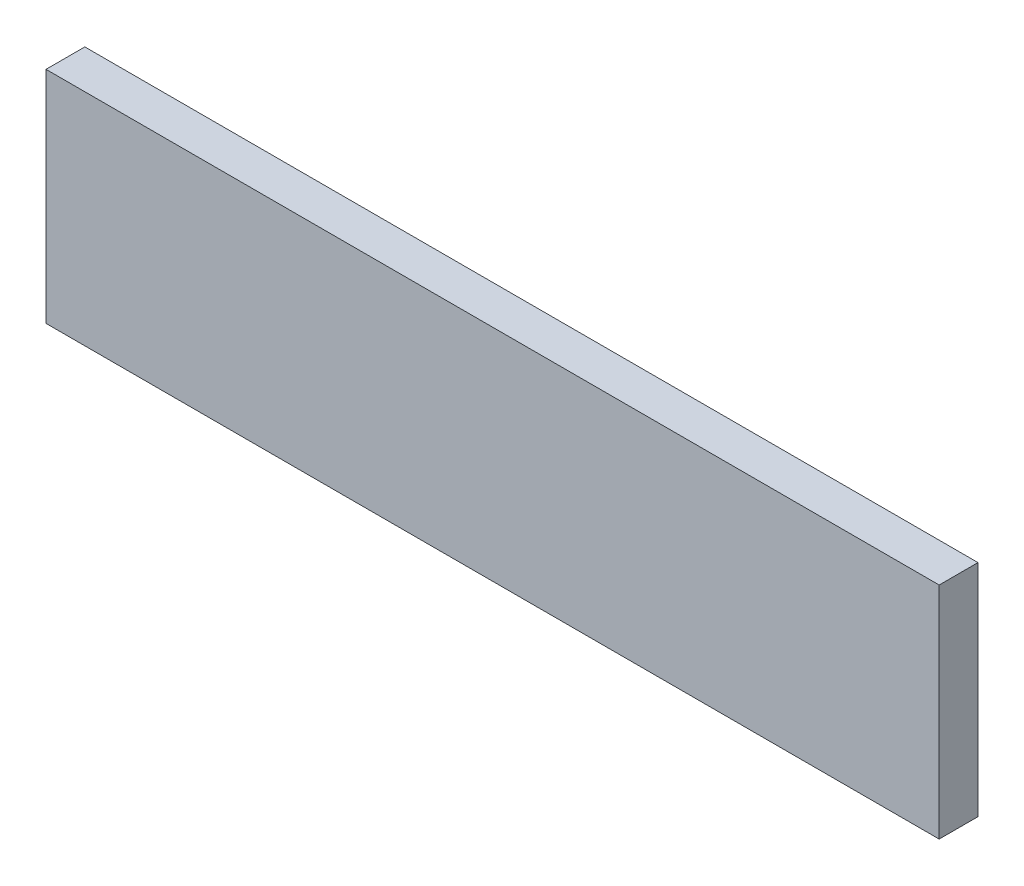
ISO-10303-21;
HEADER;
FILE_DESCRIPTION(('STEP AP214'),'2;1');
FILE_NAME('part.step','',(''),(''),'','','');
FILE_SCHEMA(('AUTOMOTIVE_DESIGN { 1 0 10303 214 1 1 1 1 }'));
ENDSEC;
DATA;
#1=APPLICATION_CONTEXT('core data for automotive mechanical design processes');
#2=APPLICATION_PROTOCOL_DEFINITION('international standard','automotive_design',2000,#1);
#3=PRODUCT_CONTEXT('',#1,'mechanical');
#4=PRODUCT('Part','Part','',(#3));
#5=PRODUCT_RELATED_PRODUCT_CATEGORY('part','',(#4));
#6=PRODUCT_DEFINITION_FORMATION('','',#4);
#7=PRODUCT_DEFINITION_CONTEXT('part definition',#1,'design');
#8=PRODUCT_DEFINITION('design','',#6,#7);
#9=PRODUCT_DEFINITION_SHAPE('','',#8);
#10=(LENGTH_UNIT() NAMED_UNIT(*) SI_UNIT(.MILLI.,.METRE.));
#11=(NAMED_UNIT(*) PLANE_ANGLE_UNIT() SI_UNIT($,.RADIAN.));
#12=(NAMED_UNIT(*) SI_UNIT($,.STERADIAN.) SOLID_ANGLE_UNIT());
#13=UNCERTAINTY_MEASURE_WITH_UNIT(LENGTH_MEASURE(1.E-05),#10,'distance_accuracy_value','');
#14=(GEOMETRIC_REPRESENTATION_CONTEXT(3) GLOBAL_UNCERTAINTY_ASSIGNED_CONTEXT((#13)) GLOBAL_UNIT_ASSIGNED_CONTEXT((#10,
#11,#12)) REPRESENTATION_CONTEXT('',''));
#15=CARTESIAN_POINT('',(0.,0.,0.));
#16=DIRECTION('',(0.,0.,1.));
#17=DIRECTION('',(1.,0.,0.));
#18=AXIS2_PLACEMENT_3D('',#15,#16,#17);
#19=CARTESIAN_POINT('',(0.,0.,19.05));
#20=DIRECTION('',(1.,0.,0.));
#21=DIRECTION('',(0.,1.,0.));
#22=AXIS2_PLACEMENT_3D('',#19,#20,#21);
#23=PLANE('',#22);
#24=DIRECTION('',(0.,-1.,0.));
#25=VECTOR('',#24,1.);
#26=CARTESIAN_POINT('',(0.,0.,0.));
#27=LINE('',#26,#25);
#28=CARTESIAN_POINT('',(0.,107.95,0.));
#29=VERTEX_POINT('',#28);
#30=CARTESIAN_POINT('',(0.,0.,0.));
#31=VERTEX_POINT('',#30);
#32=EDGE_CURVE('E107',#29,#31,#27,.T.);
#33=ORIENTED_EDGE('',*,*,#32,.T.);
#34=DIRECTION('',(0.,0.,-1.));
#35=VECTOR('',#34,1.);
#36=CARTESIAN_POINT('',(0.,0.,19.05));
#37=LINE('',#36,#35);
#38=CARTESIAN_POINT('',(0.,0.,19.05));
#39=VERTEX_POINT('',#38);
#40=EDGE_CURVE('E11',#39,#31,#37,.T.);
#41=ORIENTED_EDGE('',*,*,#40,.F.);
#42=DIRECTION('',(0.,-1.,0.));
#43=VECTOR('',#42,1.);
#44=CARTESIAN_POINT('',(0.,0.,19.05));
#45=LINE('',#44,#43);
#46=CARTESIAN_POINT('',(0.,107.95,19.05));
#47=VERTEX_POINT('',#46);
#48=EDGE_CURVE('E91',#47,#39,#45,.T.);
#49=ORIENTED_EDGE('',*,*,#48,.F.);
#50=DIRECTION('',(0.,0.,-1.));
#51=VECTOR('',#50,1.);
#52=CARTESIAN_POINT('',(0.,107.95,19.05));
#53=LINE('',#52,#51);
#54=EDGE_CURVE('E103',#47,#29,#53,.T.);
#55=ORIENTED_EDGE('',*,*,#54,.T.);
#56=EDGE_LOOP('',(#33,#41,#49,#55));
#57=FACE_BOUND('',#56,.T.);
#58=ADVANCED_FACE('F39',(#57),#23,.F.);
#59=CARTESIAN_POINT('',(0.,0.,19.05));
#60=DIRECTION('',(0.,1.,0.));
#61=DIRECTION('',(0.,0.,1.));
#62=AXIS2_PLACEMENT_3D('',#59,#60,#61);
#63=PLANE('',#62);
#64=DIRECTION('',(1.,0.,0.));
#65=VECTOR('',#64,1.);
#66=CARTESIAN_POINT('',(0.,0.,0.));
#67=LINE('',#66,#65);
#68=CARTESIAN_POINT('',(438.15,0.,0.));
#69=VERTEX_POINT('',#68);
#70=EDGE_CURVE('E96',#31,#69,#67,.T.);
#71=ORIENTED_EDGE('',*,*,#70,.T.);
#72=DIRECTION('',(0.,0.,-1.));
#73=VECTOR('',#72,1.);
#74=CARTESIAN_POINT('',(438.15,0.,19.05));
#75=LINE('',#74,#73);
#76=CARTESIAN_POINT('',(438.15,0.,19.05));
#77=VERTEX_POINT('',#76);
#78=EDGE_CURVE('E48',#77,#69,#75,.T.);
#79=ORIENTED_EDGE('',*,*,#78,.F.);
#80=DIRECTION('',(1.,0.,0.));
#81=VECTOR('',#80,1.);
#82=CARTESIAN_POINT('',(0.,0.,19.05));
#83=LINE('',#82,#81);
#84=EDGE_CURVE('E86',#39,#77,#83,.T.);
#85=ORIENTED_EDGE('',*,*,#84,.F.);
#86=ORIENTED_EDGE('',*,*,#40,.T.);
#87=EDGE_LOOP('',(#71,#79,#85,#86));
#88=FACE_BOUND('',#87,.T.);
#89=ADVANCED_FACE('F95',(#88),#63,.F.);
#90=CARTESIAN_POINT('',(438.15,0.,19.05));
#91=DIRECTION('',(-1.,0.,0.));
#92=DIRECTION('',(0.,-1.,0.));
#93=AXIS2_PLACEMENT_3D('',#90,#91,#92);
#94=PLANE('',#93);
#95=DIRECTION('',(0.,1.,0.));
#96=VECTOR('',#95,1.);
#97=CARTESIAN_POINT('',(438.15,0.,0.));
#98=LINE('',#97,#96);
#99=CARTESIAN_POINT('',(438.15,107.95,0.));
#100=VERTEX_POINT('',#99);
#101=EDGE_CURVE('E73',#69,#100,#98,.T.);
#102=ORIENTED_EDGE('',*,*,#101,.T.);
#103=DIRECTION('',(0.,0.,-1.));
#104=VECTOR('',#103,1.);
#105=CARTESIAN_POINT('',(438.15,107.95,19.05));
#106=LINE('',#105,#104);
#107=CARTESIAN_POINT('',(438.15,107.95,19.05));
#108=VERTEX_POINT('',#107);
#109=EDGE_CURVE('E98',#108,#100,#106,.T.);
#110=ORIENTED_EDGE('',*,*,#109,.F.);
#111=DIRECTION('',(0.,1.,0.));
#112=VECTOR('',#111,1.);
#113=CARTESIAN_POINT('',(438.15,0.,19.05));
#114=LINE('',#113,#112);
#115=EDGE_CURVE('E89',#77,#108,#114,.T.);
#116=ORIENTED_EDGE('',*,*,#115,.F.);
#117=ORIENTED_EDGE('',*,*,#78,.T.);
#118=EDGE_LOOP('',(#102,#110,#116,#117));
#119=FACE_BOUND('',#118,.T.);
#120=ADVANCED_FACE('F99',(#119),#94,.F.);
#121=CARTESIAN_POINT('',(0.,107.95,19.05));
#122=DIRECTION('',(0.,-1.,0.));
#123=DIRECTION('',(0.,0.,-1.));
#124=AXIS2_PLACEMENT_3D('',#121,#122,#123);
#125=PLANE('',#124);
#126=DIRECTION('',(-1.,0.,0.));
#127=VECTOR('',#126,1.);
#128=CARTESIAN_POINT('',(0.,107.95,0.));
#129=LINE('',#128,#127);
#130=EDGE_CURVE('E79',#100,#29,#129,.T.);
#131=ORIENTED_EDGE('',*,*,#130,.T.);
#132=ORIENTED_EDGE('',*,*,#54,.F.);
#133=DIRECTION('',(-1.,0.,0.));
#134=VECTOR('',#133,1.);
#135=CARTESIAN_POINT('',(0.,107.95,19.05));
#136=LINE('',#135,#134);
#137=EDGE_CURVE('E56',#108,#47,#136,.T.);
#138=ORIENTED_EDGE('',*,*,#137,.F.);
#139=ORIENTED_EDGE('',*,*,#109,.T.);
#140=EDGE_LOOP('',(#131,#132,#138,#139));
#141=FACE_BOUND('',#140,.T.);
#142=ADVANCED_FACE('F120',(#141),#125,.F.);
#143=CARTESIAN_POINT('',(0.,0.,19.05));
#144=DIRECTION('',(0.,0.,-1.));
#145=DIRECTION('',(-1.,0.,0.));
#146=AXIS2_PLACEMENT_3D('',#143,#144,#145);
#147=PLANE('',#146);
#148=ORIENTED_EDGE('',*,*,#48,.T.);
#149=ORIENTED_EDGE('',*,*,#84,.T.);
#150=ORIENTED_EDGE('',*,*,#115,.T.);
#151=ORIENTED_EDGE('',*,*,#137,.T.);
#152=EDGE_LOOP('',(#148,#149,#150,#151));
#153=FACE_BOUND('',#152,.T.);
#154=ADVANCED_FACE('F87',(#153),#147,.F.);
#155=CARTESIAN_POINT('',(0.,0.,0.));
#156=DIRECTION('',(0.,0.,-1.));
#157=DIRECTION('',(-1.,0.,0.));
#158=AXIS2_PLACEMENT_3D('',#155,#156,#157);
#159=PLANE('',#158);
#160=ORIENTED_EDGE('',*,*,#32,.F.);
#161=ORIENTED_EDGE('',*,*,#130,.F.);
#162=ORIENTED_EDGE('',*,*,#101,.F.);
#163=ORIENTED_EDGE('',*,*,#70,.F.);
#164=EDGE_LOOP('',(#160,#161,#162,#163));
#165=FACE_BOUND('',#164,.T.);
#166=ADVANCED_FACE('F123',(#165),#159,.T.);
#167=CLOSED_SHELL('',(#58,#89,#120,#142,#154,#166));
#168=MANIFOLD_SOLID_BREP('B2',#167);
#169=ADVANCED_BREP_SHAPE_REPRESENTATION('',(#18,#168),#14);
#170=SHAPE_DEFINITION_REPRESENTATION(#9,#169);
ENDSEC;
END-ISO-10303-21;
